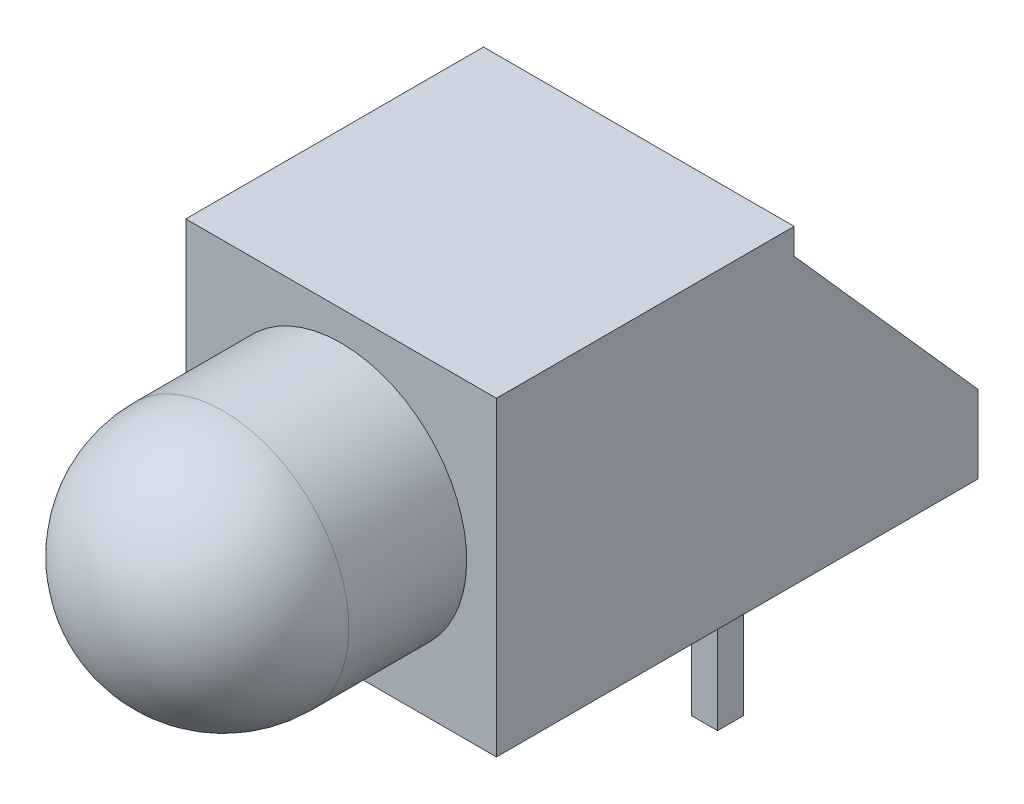
ISO-10303-21;
HEADER;
FILE_DESCRIPTION(('STEP AP214'),'2;1');
FILE_NAME('part.step','',(''),(''),'','','');
FILE_SCHEMA(('AUTOMOTIVE_DESIGN { 1 0 10303 214 1 1 1 1 }'));
ENDSEC;
DATA;
#1=APPLICATION_CONTEXT('core data for automotive mechanical design processes');
#2=APPLICATION_PROTOCOL_DEFINITION('international standard','automotive_design',2000,#1);
#3=PRODUCT_CONTEXT('',#1,'mechanical');
#4=PRODUCT('Part','Part','',(#3));
#5=PRODUCT_RELATED_PRODUCT_CATEGORY('part','',(#4));
#6=PRODUCT_DEFINITION_FORMATION('','',#4);
#7=PRODUCT_DEFINITION_CONTEXT('part definition',#1,'design');
#8=PRODUCT_DEFINITION('design','',#6,#7);
#9=PRODUCT_DEFINITION_SHAPE('','',#8);
#10=(LENGTH_UNIT() NAMED_UNIT(*) SI_UNIT(.MILLI.,.METRE.));
#11=(NAMED_UNIT(*) PLANE_ANGLE_UNIT() SI_UNIT($,.RADIAN.));
#12=(NAMED_UNIT(*) SI_UNIT($,.STERADIAN.) SOLID_ANGLE_UNIT());
#13=UNCERTAINTY_MEASURE_WITH_UNIT(LENGTH_MEASURE(1.E-05),#10,'distance_accuracy_value','');
#14=(GEOMETRIC_REPRESENTATION_CONTEXT(3) GLOBAL_UNCERTAINTY_ASSIGNED_CONTEXT((#13)) GLOBAL_UNIT_ASSIGNED_CONTEXT((#10,
#11,#12)) REPRESENTATION_CONTEXT('',''));
#15=CARTESIAN_POINT('',(0.,0.,0.));
#16=DIRECTION('',(0.,0.,1.));
#17=DIRECTION('',(1.,0.,0.));
#18=AXIS2_PLACEMENT_3D('',#15,#16,#17);
#19=CARTESIAN_POINT('',(3.,0.,6.));
#20=DIRECTION('',(0.,1.,0.));
#21=DIRECTION('',(0.,0.,1.));
#22=AXIS2_PLACEMENT_3D('',#19,#20,#21);
#23=PLANE('',#22);
#24=DIRECTION('',(0.,0.,-1.));
#25=VECTOR('',#24,1.);
#26=CARTESIAN_POINT('',(-1.52,0.,0.25));
#27=LINE('',#26,#25);
#28=CARTESIAN_POINT('',(-1.52,0.,0.25));
#29=VERTEX_POINT('',#28);
#30=CARTESIAN_POINT('',(-1.52,0.,-0.25));
#31=VERTEX_POINT('',#30);
#32=EDGE_CURVE('E140',#29,#31,#27,.T.);
#33=ORIENTED_EDGE('',*,*,#32,.F.);
#34=DIRECTION('',(-1.,0.,0.));
#35=VECTOR('',#34,1.);
#36=CARTESIAN_POINT('',(-1.52,0.,0.25));
#37=LINE('',#36,#35);
#38=CARTESIAN_POINT('',(-1.02,0.,0.25));
#39=VERTEX_POINT('',#38);
#40=EDGE_CURVE('E173',#39,#29,#37,.T.);
#41=ORIENTED_EDGE('',*,*,#40,.F.);
#42=DIRECTION('',(0.,0.,1.));
#43=VECTOR('',#42,1.);
#44=CARTESIAN_POINT('',(-1.02,0.,0.25));
#45=LINE('',#44,#43);
#46=CARTESIAN_POINT('',(-1.02,0.,-0.25));
#47=VERTEX_POINT('',#46);
#48=EDGE_CURVE('E185',#47,#39,#45,.T.);
#49=ORIENTED_EDGE('',*,*,#48,.F.);
#50=DIRECTION('',(1.,0.,0.));
#51=VECTOR('',#50,1.);
#52=CARTESIAN_POINT('',(-1.52,0.,-0.25));
#53=LINE('',#52,#51);
#54=EDGE_CURVE('E182',#31,#47,#53,.T.);
#55=ORIENTED_EDGE('',*,*,#54,.F.);
#56=EDGE_LOOP('',(#33,#41,#49,#55));
#57=FACE_BOUND('',#56,.T.);
#58=DIRECTION('',(0.,0.,-1.));
#59=VECTOR('',#58,1.);
#60=CARTESIAN_POINT('',(-3.,0.,6.));
#61=LINE('',#60,#59);
#62=CARTESIAN_POINT('',(-3.,0.,6.));
#63=VERTEX_POINT('',#62);
#64=CARTESIAN_POINT('',(-3.,0.,-3.3));
#65=VERTEX_POINT('',#64);
#66=EDGE_CURVE('E207',#63,#65,#61,.T.);
#67=ORIENTED_EDGE('',*,*,#66,.T.);
#68=DIRECTION('',(-1.,0.,0.));
#69=VECTOR('',#68,1.);
#70=CARTESIAN_POINT('',(3.,0.,-3.3));
#71=LINE('',#70,#69);
#72=CARTESIAN_POINT('',(3.,0.,-3.3));
#73=VERTEX_POINT('',#72);
#74=EDGE_CURVE('E11',#73,#65,#71,.T.);
#75=ORIENTED_EDGE('',*,*,#74,.F.);
#76=DIRECTION('',(0.,0.,-1.));
#77=VECTOR('',#76,1.);
#78=CARTESIAN_POINT('',(3.,0.,6.));
#79=LINE('',#78,#77);
#80=CARTESIAN_POINT('',(3.,0.,6.));
#81=VERTEX_POINT('',#80);
#82=EDGE_CURVE('E208',#81,#73,#79,.T.);
#83=ORIENTED_EDGE('',*,*,#82,.F.);
#84=DIRECTION('',(-1.,0.,0.));
#85=VECTOR('',#84,1.);
#86=CARTESIAN_POINT('',(3.,0.,6.));
#87=LINE('',#86,#85);
#88=EDGE_CURVE('E222',#81,#63,#87,.T.);
#89=ORIENTED_EDGE('',*,*,#88,.T.);
#90=EDGE_LOOP('',(#67,#75,#83,#89));
#91=FACE_BOUND('',#90,.T.);
#92=DIRECTION('',(0.,0.,1.));
#93=VECTOR('',#92,1.);
#94=CARTESIAN_POINT('',(1.52,0.,0.25));
#95=LINE('',#94,#93);
#96=CARTESIAN_POINT('',(1.52,0.,-0.25));
#97=VERTEX_POINT('',#96);
#98=CARTESIAN_POINT('',(1.52,0.,0.25));
#99=VERTEX_POINT('',#98);
#100=EDGE_CURVE('E134',#97,#99,#95,.T.);
#101=ORIENTED_EDGE('',*,*,#100,.F.);
#102=DIRECTION('',(1.,0.,0.));
#103=VECTOR('',#102,1.);
#104=CARTESIAN_POINT('',(1.52,0.,-0.25));
#105=LINE('',#104,#103);
#106=CARTESIAN_POINT('',(1.02,0.,-0.25));
#107=VERTEX_POINT('',#106);
#108=EDGE_CURVE('E136',#107,#97,#105,.T.);
#109=ORIENTED_EDGE('',*,*,#108,.F.);
#110=DIRECTION('',(0.,0.,-1.));
#111=VECTOR('',#110,1.);
#112=CARTESIAN_POINT('',(1.02,0.,0.25));
#113=LINE('',#112,#111);
#114=CARTESIAN_POINT('',(1.02,0.,0.25));
#115=VERTEX_POINT('',#114);
#116=EDGE_CURVE('E57',#115,#107,#113,.T.);
#117=ORIENTED_EDGE('',*,*,#116,.F.);
#118=DIRECTION('',(-1.,0.,0.));
#119=VECTOR('',#118,1.);
#120=CARTESIAN_POINT('',(1.52,0.,0.25));
#121=LINE('',#120,#119);
#122=EDGE_CURVE('E52',#99,#115,#121,.T.);
#123=ORIENTED_EDGE('',*,*,#122,.F.);
#124=EDGE_LOOP('',(#101,#109,#117,#123));
#125=FACE_BOUND('',#124,.T.);
#126=ADVANCED_FACE('F38',(#57,#91,#125),#23,.F.);
#127=CARTESIAN_POINT('',(3.,1.5,-3.3));
#128=DIRECTION('',(0.,0.,1.));
#129=DIRECTION('',(1.,0.,0.));
#130=AXIS2_PLACEMENT_3D('',#127,#128,#129);
#131=PLANE('',#130);
#132=DIRECTION('',(0.,1.,0.));
#133=VECTOR('',#132,1.);
#134=CARTESIAN_POINT('',(-3.,1.5,-3.3));
#135=LINE('',#134,#133);
#136=CARTESIAN_POINT('',(-3.,1.5,-3.3));
#137=VERTEX_POINT('',#136);
#138=EDGE_CURVE('E225',#65,#137,#135,.T.);
#139=ORIENTED_EDGE('',*,*,#138,.T.);
#140=DIRECTION('',(-1.,0.,0.));
#141=VECTOR('',#140,1.);
#142=CARTESIAN_POINT('',(3.,1.5,-3.3));
#143=LINE('',#142,#141);
#144=CARTESIAN_POINT('',(3.,1.5,-3.3));
#145=VERTEX_POINT('',#144);
#146=EDGE_CURVE('E45',#145,#137,#143,.T.);
#147=ORIENTED_EDGE('',*,*,#146,.F.);
#148=DIRECTION('',(0.,1.,0.));
#149=VECTOR('',#148,1.);
#150=CARTESIAN_POINT('',(3.,1.5,-3.3));
#151=LINE('',#150,#149);
#152=EDGE_CURVE('E211',#73,#145,#151,.T.);
#153=ORIENTED_EDGE('',*,*,#152,.F.);
#154=ORIENTED_EDGE('',*,*,#74,.T.);
#155=EDGE_LOOP('',(#139,#147,#153,#154));
#156=FACE_BOUND('',#155,.T.);
#157=ADVANCED_FACE('F272',(#156),#131,.F.);
#158=CARTESIAN_POINT('',(3.,5.5,0.25));
#159=DIRECTION('',(0.,-0.663783352029829,0.747924903695581));
#160=DIRECTION('',(0.,-0.747924903695581,-0.663783352029829));
#161=AXIS2_PLACEMENT_3D('',#158,#159,#160);
#162=PLANE('',#161);
#163=DIRECTION('',(0.,0.747924903695581,0.663783352029829));
#164=VECTOR('',#163,1.);
#165=CARTESIAN_POINT('',(-3.,5.5,0.25));
#166=LINE('',#165,#164);
#167=CARTESIAN_POINT('',(-3.,5.5,0.25));
#168=VERTEX_POINT('',#167);
#169=EDGE_CURVE('E227',#137,#168,#166,.T.);
#170=ORIENTED_EDGE('',*,*,#169,.T.);
#171=DIRECTION('',(-1.,0.,0.));
#172=VECTOR('',#171,1.);
#173=CARTESIAN_POINT('',(3.,5.5,0.25));
#174=LINE('',#173,#172);
#175=CARTESIAN_POINT('',(3.,5.5,0.25));
#176=VERTEX_POINT('',#175);
#177=EDGE_CURVE('E242',#176,#168,#174,.T.);
#178=ORIENTED_EDGE('',*,*,#177,.F.);
#179=DIRECTION('',(0.,0.747924903695581,0.663783352029829));
#180=VECTOR('',#179,1.);
#181=CARTESIAN_POINT('',(3.,5.5,0.25));
#182=LINE('',#181,#180);
#183=EDGE_CURVE('E214',#145,#176,#182,.T.);
#184=ORIENTED_EDGE('',*,*,#183,.F.);
#185=ORIENTED_EDGE('',*,*,#146,.T.);
#186=EDGE_LOOP('',(#170,#178,#184,#185));
#187=FACE_BOUND('',#186,.T.);
#188=ADVANCED_FACE('F249',(#187),#162,.F.);
#189=CARTESIAN_POINT('',(3.,6.,0.249999999999999));
#190=DIRECTION('',(0.,0.,1.));
#191=DIRECTION('',(0.,-1.,0.));
#192=AXIS2_PLACEMENT_3D('',#189,#190,#191);
#193=PLANE('',#192);
#194=DIRECTION('',(0.,1.,0.));
#195=VECTOR('',#194,1.);
#196=CARTESIAN_POINT('',(-3.,6.,0.249999999999999));
#197=LINE('',#196,#195);
#198=CARTESIAN_POINT('',(-3.,6.,0.249999999999999));
#199=VERTEX_POINT('',#198);
#200=EDGE_CURVE('E229',#168,#199,#197,.T.);
#201=ORIENTED_EDGE('',*,*,#200,.T.);
#202=DIRECTION('',(-1.,0.,0.));
#203=VECTOR('',#202,1.);
#204=CARTESIAN_POINT('',(3.,6.,0.249999999999999));
#205=LINE('',#204,#203);
#206=CARTESIAN_POINT('',(3.,6.,0.249999999999999));
#207=VERTEX_POINT('',#206);
#208=EDGE_CURVE('E239',#207,#199,#205,.T.);
#209=ORIENTED_EDGE('',*,*,#208,.F.);
#210=DIRECTION('',(0.,1.,0.));
#211=VECTOR('',#210,1.);
#212=CARTESIAN_POINT('',(3.,6.,0.249999999999999));
#213=LINE('',#212,#211);
#214=EDGE_CURVE('E216',#176,#207,#213,.T.);
#215=ORIENTED_EDGE('',*,*,#214,.F.);
#216=ORIENTED_EDGE('',*,*,#177,.T.);
#217=EDGE_LOOP('',(#201,#209,#215,#216));
#218=FACE_BOUND('',#217,.T.);
#219=ADVANCED_FACE('F260',(#218),#193,.F.);
#220=CARTESIAN_POINT('',(3.,6.,0.249999999999999));
#221=DIRECTION('',(0.,-1.,0.));
#222=DIRECTION('',(0.,0.,-1.));
#223=AXIS2_PLACEMENT_3D('',#220,#221,#222);
#224=PLANE('',#223);
#225=DIRECTION('',(0.,0.,1.));
#226=VECTOR('',#225,1.);
#227=CARTESIAN_POINT('',(-3.,6.,0.249999999999999));
#228=LINE('',#227,#226);
#229=CARTESIAN_POINT('',(-3.,6.,6.));
#230=VERTEX_POINT('',#229);
#231=EDGE_CURVE('E231',#199,#230,#228,.T.);
#232=ORIENTED_EDGE('',*,*,#231,.T.);
#233=DIRECTION('',(-1.,0.,0.));
#234=VECTOR('',#233,1.);
#235=CARTESIAN_POINT('',(3.,6.,6.));
#236=LINE('',#235,#234);
#237=CARTESIAN_POINT('',(3.,6.,6.));
#238=VERTEX_POINT('',#237);
#239=EDGE_CURVE('E236',#238,#230,#236,.T.);
#240=ORIENTED_EDGE('',*,*,#239,.F.);
#241=DIRECTION('',(0.,0.,1.));
#242=VECTOR('',#241,1.);
#243=CARTESIAN_POINT('',(3.,6.,0.249999999999999));
#244=LINE('',#243,#242);
#245=EDGE_CURVE('E218',#207,#238,#244,.T.);
#246=ORIENTED_EDGE('',*,*,#245,.F.);
#247=ORIENTED_EDGE('',*,*,#208,.T.);
#248=EDGE_LOOP('',(#232,#240,#246,#247));
#249=FACE_BOUND('',#248,.T.);
#250=ADVANCED_FACE('F264',(#249),#224,.F.);
#251=CARTESIAN_POINT('',(3.,6.,6.));
#252=DIRECTION('',(0.,0.,-1.));
#253=DIRECTION('',(0.,1.,0.));
#254=AXIS2_PLACEMENT_3D('',#251,#252,#253);
#255=PLANE('',#254);
#256=CARTESIAN_POINT('',(0.,3.,6.));
#257=DIRECTION('',(0.,0.,-1.));
#258=DIRECTION('',(0.,1.,0.));
#259=AXIS2_PLACEMENT_3D('',#256,#257,#258);
#260=CIRCLE('',#259,2.425);
#261=CARTESIAN_POINT('',(0.,5.425,6.));
#262=VERTEX_POINT('',#261);
#263=EDGE_CURVE('E204',#262,#262,#260,.T.);
#264=ORIENTED_EDGE('',*,*,#263,.T.);
#265=EDGE_LOOP('',(#264));
#266=FACE_BOUND('',#265,.T.);
#267=DIRECTION('',(0.,-1.,0.));
#268=VECTOR('',#267,1.);
#269=CARTESIAN_POINT('',(-3.,6.,6.));
#270=LINE('',#269,#268);
#271=EDGE_CURVE('E212',#230,#63,#270,.T.);
#272=ORIENTED_EDGE('',*,*,#271,.T.);
#273=ORIENTED_EDGE('',*,*,#88,.F.);
#274=DIRECTION('',(0.,-1.,0.));
#275=VECTOR('',#274,1.);
#276=CARTESIAN_POINT('',(3.,6.,6.));
#277=LINE('',#276,#275);
#278=EDGE_CURVE('E220',#238,#81,#277,.T.);
#279=ORIENTED_EDGE('',*,*,#278,.F.);
#280=ORIENTED_EDGE('',*,*,#239,.T.);
#281=EDGE_LOOP('',(#272,#273,#279,#280));
#282=FACE_BOUND('',#281,.T.);
#283=ADVANCED_FACE('F275',(#266,#282),#255,.F.);
#284=CARTESIAN_POINT('',(3.,0.,0.));
#285=DIRECTION('',(-1.,0.,0.));
#286=DIRECTION('',(0.,0.,1.));
#287=AXIS2_PLACEMENT_3D('',#284,#285,#286);
#288=PLANE('',#287);
#289=ORIENTED_EDGE('',*,*,#82,.T.);
#290=ORIENTED_EDGE('',*,*,#152,.T.);
#291=ORIENTED_EDGE('',*,*,#183,.T.);
#292=ORIENTED_EDGE('',*,*,#214,.T.);
#293=ORIENTED_EDGE('',*,*,#245,.T.);
#294=ORIENTED_EDGE('',*,*,#278,.T.);
#295=EDGE_LOOP('',(#289,#290,#291,#292,#293,#294));
#296=FACE_BOUND('',#295,.T.);
#297=ADVANCED_FACE('F268',(#296),#288,.F.);
#298=CARTESIAN_POINT('',(-3.,0.,0.));
#299=DIRECTION('',(-1.,0.,0.));
#300=DIRECTION('',(0.,0.,1.));
#301=AXIS2_PLACEMENT_3D('',#298,#299,#300);
#302=PLANE('',#301);
#303=ORIENTED_EDGE('',*,*,#66,.F.);
#304=ORIENTED_EDGE('',*,*,#271,.F.);
#305=ORIENTED_EDGE('',*,*,#231,.F.);
#306=ORIENTED_EDGE('',*,*,#200,.F.);
#307=ORIENTED_EDGE('',*,*,#169,.F.);
#308=ORIENTED_EDGE('',*,*,#138,.F.);
#309=EDGE_LOOP('',(#303,#304,#305,#306,#307,#308));
#310=FACE_BOUND('',#309,.T.);
#311=ADVANCED_FACE('F255',(#310),#302,.T.);
#312=CARTESIAN_POINT('',(0.,3.,6.));
#313=DIRECTION('',(0.,0.,-1.));
#314=DIRECTION('',(0.,1.,0.));
#315=AXIS2_PLACEMENT_3D('',#312,#313,#314);
#316=CYLINDRICAL_SURFACE('',#315,2.425);
#317=CARTESIAN_POINT('',(0.,3.,8.275));
#318=DIRECTION('',(0.,0.,-1.));
#319=DIRECTION('',(0.,1.,0.));
#320=AXIS2_PLACEMENT_3D('',#317,#318,#319);
#321=CIRCLE('',#320,2.425);
#322=CARTESIAN_POINT('',(0.,5.425,8.275));
#323=VERTEX_POINT('',#322);
#324=EDGE_CURVE('E201',#323,#323,#321,.T.);
#325=ORIENTED_EDGE('',*,*,#324,.T.);
#326=EDGE_LOOP('',(#325));
#327=FACE_BOUND('',#326,.T.);
#328=ORIENTED_EDGE('',*,*,#263,.F.);
#329=EDGE_LOOP('',(#328));
#330=FACE_BOUND('',#329,.T.);
#331=ADVANCED_FACE('F321',(#327,#330),#316,.T.);
#332=CARTESIAN_POINT('',(0.,3.,8.275));
#333=DIRECTION('',(0.,0.,-1.));
#334=DIRECTION('',(0.,1.,0.));
#335=AXIS2_PLACEMENT_3D('',#332,#333,#334);
#336=SPHERICAL_SURFACE('',#335,2.425);
#337=ORIENTED_EDGE('',*,*,#324,.F.);
#338=EDGE_LOOP('',(#337));
#339=FACE_BOUND('',#338,.T.);
#340=ADVANCED_FACE('F315',(#339),#336,.T.);
#341=CARTESIAN_POINT('',(-1.52,-3.175,0.25));
#342=DIRECTION('',(1.,0.,0.));
#343=DIRECTION('',(0.,0.,-1.));
#344=AXIS2_PLACEMENT_3D('',#341,#342,#343);
#345=PLANE('',#344);
#346=ORIENTED_EDGE('',*,*,#32,.T.);
#347=DIRECTION('',(0.,1.,0.));
#348=VECTOR('',#347,1.);
#349=CARTESIAN_POINT('',(-1.52,-3.175,-0.25));
#350=LINE('',#349,#348);
#351=CARTESIAN_POINT('',(-1.52,-3.175,-0.25));
#352=VERTEX_POINT('',#351);
#353=EDGE_CURVE('E198',#352,#31,#350,.T.);
#354=ORIENTED_EDGE('',*,*,#353,.F.);
#355=DIRECTION('',(0.,0.,-1.));
#356=VECTOR('',#355,1.);
#357=CARTESIAN_POINT('',(-1.52,-3.175,0.25));
#358=LINE('',#357,#356);
#359=CARTESIAN_POINT('',(-1.52,-3.175,0.25));
#360=VERTEX_POINT('',#359);
#361=EDGE_CURVE('E169',#360,#352,#358,.T.);
#362=ORIENTED_EDGE('',*,*,#361,.F.);
#363=DIRECTION('',(0.,1.,0.));
#364=VECTOR('',#363,1.);
#365=CARTESIAN_POINT('',(-1.52,-3.175,0.25));
#366=LINE('',#365,#364);
#367=EDGE_CURVE('E179',#360,#29,#366,.T.);
#368=ORIENTED_EDGE('',*,*,#367,.T.);
#369=EDGE_LOOP('',(#346,#354,#362,#368));
#370=FACE_BOUND('',#369,.T.);
#371=ADVANCED_FACE('F299',(#370),#345,.F.);
#372=CARTESIAN_POINT('',(-1.52,-3.175,-0.25));
#373=DIRECTION('',(0.,0.,1.));
#374=DIRECTION('',(1.,0.,0.));
#375=AXIS2_PLACEMENT_3D('',#372,#373,#374);
#376=PLANE('',#375);
#377=ORIENTED_EDGE('',*,*,#54,.T.);
#378=DIRECTION('',(0.,1.,0.));
#379=VECTOR('',#378,1.);
#380=CARTESIAN_POINT('',(-1.02,-3.175,-0.25));
#381=LINE('',#380,#379);
#382=CARTESIAN_POINT('',(-1.02,-3.175,-0.25));
#383=VERTEX_POINT('',#382);
#384=EDGE_CURVE('E195',#383,#47,#381,.T.);
#385=ORIENTED_EDGE('',*,*,#384,.F.);
#386=DIRECTION('',(1.,0.,0.));
#387=VECTOR('',#386,1.);
#388=CARTESIAN_POINT('',(-1.52,-3.175,-0.25));
#389=LINE('',#388,#387);
#390=EDGE_CURVE('E172',#352,#383,#389,.T.);
#391=ORIENTED_EDGE('',*,*,#390,.F.);
#392=ORIENTED_EDGE('',*,*,#353,.T.);
#393=EDGE_LOOP('',(#377,#385,#391,#392));
#394=FACE_BOUND('',#393,.T.);
#395=ADVANCED_FACE('F307',(#394),#376,.F.);
#396=CARTESIAN_POINT('',(-1.02,-3.175,0.25));
#397=DIRECTION('',(-1.,0.,0.));
#398=DIRECTION('',(0.,0.,1.));
#399=AXIS2_PLACEMENT_3D('',#396,#397,#398);
#400=PLANE('',#399);
#401=ORIENTED_EDGE('',*,*,#48,.T.);
#402=DIRECTION('',(0.,1.,0.));
#403=VECTOR('',#402,1.);
#404=CARTESIAN_POINT('',(-1.02,-3.175,0.25));
#405=LINE('',#404,#403);
#406=CARTESIAN_POINT('',(-1.02,-3.175,0.25));
#407=VERTEX_POINT('',#406);
#408=EDGE_CURVE('E192',#407,#39,#405,.T.);
#409=ORIENTED_EDGE('',*,*,#408,.F.);
#410=DIRECTION('',(0.,0.,1.));
#411=VECTOR('',#410,1.);
#412=CARTESIAN_POINT('',(-1.02,-3.175,0.25));
#413=LINE('',#412,#411);
#414=EDGE_CURVE('E175',#383,#407,#413,.T.);
#415=ORIENTED_EDGE('',*,*,#414,.F.);
#416=ORIENTED_EDGE('',*,*,#384,.T.);
#417=EDGE_LOOP('',(#401,#409,#415,#416));
#418=FACE_BOUND('',#417,.T.);
#419=ADVANCED_FACE('F305',(#418),#400,.F.);
#420=CARTESIAN_POINT('',(-1.52,-3.175,0.25));
#421=DIRECTION('',(0.,0.,-1.));
#422=DIRECTION('',(-1.,0.,0.));
#423=AXIS2_PLACEMENT_3D('',#420,#421,#422);
#424=PLANE('',#423);
#425=ORIENTED_EDGE('',*,*,#40,.T.);
#426=ORIENTED_EDGE('',*,*,#367,.F.);
#427=DIRECTION('',(-1.,0.,0.));
#428=VECTOR('',#427,1.);
#429=CARTESIAN_POINT('',(-1.52,-3.175,0.25));
#430=LINE('',#429,#428);
#431=EDGE_CURVE('E177',#407,#360,#430,.T.);
#432=ORIENTED_EDGE('',*,*,#431,.F.);
#433=ORIENTED_EDGE('',*,*,#408,.T.);
#434=EDGE_LOOP('',(#425,#426,#432,#433));
#435=FACE_BOUND('',#434,.T.);
#436=ADVANCED_FACE('F295',(#435),#424,.F.);
#437=CARTESIAN_POINT('',(0.,-3.175,0.));
#438=DIRECTION('',(0.,-1.,0.));
#439=DIRECTION('',(0.,0.,-1.));
#440=AXIS2_PLACEMENT_3D('',#437,#438,#439);
#441=PLANE('',#440);
#442=ORIENTED_EDGE('',*,*,#361,.T.);
#443=ORIENTED_EDGE('',*,*,#390,.T.);
#444=ORIENTED_EDGE('',*,*,#414,.T.);
#445=ORIENTED_EDGE('',*,*,#431,.T.);
#446=EDGE_LOOP('',(#442,#443,#444,#445));
#447=FACE_BOUND('',#446,.T.);
#448=ADVANCED_FACE('F301',(#447),#441,.T.);
#449=CARTESIAN_POINT('',(1.52,-3.175,0.25));
#450=DIRECTION('',(-1.,0.,0.));
#451=DIRECTION('',(0.,0.,1.));
#452=AXIS2_PLACEMENT_3D('',#449,#450,#451);
#453=PLANE('',#452);
#454=ORIENTED_EDGE('',*,*,#100,.T.);
#455=DIRECTION('',(0.,1.,0.));
#456=VECTOR('',#455,1.);
#457=CARTESIAN_POINT('',(1.52,-3.175,0.25));
#458=LINE('',#457,#456);
#459=CARTESIAN_POINT('',(1.52,-3.175,0.25));
#460=VERTEX_POINT('',#459);
#461=EDGE_CURVE('E543',#460,#99,#458,.T.);
#462=ORIENTED_EDGE('',*,*,#461,.F.);
#463=DIRECTION('',(0.,0.,1.));
#464=VECTOR('',#463,1.);
#465=CARTESIAN_POINT('',(1.52,-3.175,0.25));
#466=LINE('',#465,#464);
#467=CARTESIAN_POINT('',(1.52,-3.175,-0.25));
#468=VERTEX_POINT('',#467);
#469=EDGE_CURVE('E151',#468,#460,#466,.T.);
#470=ORIENTED_EDGE('',*,*,#469,.F.);
#471=DIRECTION('',(0.,1.,0.));
#472=VECTOR('',#471,1.);
#473=CARTESIAN_POINT('',(1.52,-3.175,-0.25));
#474=LINE('',#473,#472);
#475=EDGE_CURVE('E147',#468,#97,#474,.T.);
#476=ORIENTED_EDGE('',*,*,#475,.T.);
#477=EDGE_LOOP('',(#454,#462,#470,#476));
#478=FACE_BOUND('',#477,.T.);
#479=ADVANCED_FACE('F153',(#478),#453,.F.);
#480=CARTESIAN_POINT('',(1.52,-3.175,0.25));
#481=DIRECTION('',(0.,0.,-1.));
#482=DIRECTION('',(-1.,0.,0.));
#483=AXIS2_PLACEMENT_3D('',#480,#481,#482);
#484=PLANE('',#483);
#485=ORIENTED_EDGE('',*,*,#122,.T.);
#486=DIRECTION('',(0.,1.,0.));
#487=VECTOR('',#486,1.);
#488=CARTESIAN_POINT('',(1.02,-3.175,0.25));
#489=LINE('',#488,#487);
#490=CARTESIAN_POINT('',(1.02,-3.175,0.25));
#491=VERTEX_POINT('',#490);
#492=EDGE_CURVE('E159',#491,#115,#489,.T.);
#493=ORIENTED_EDGE('',*,*,#492,.F.);
#494=DIRECTION('',(-1.,0.,0.));
#495=VECTOR('',#494,1.);
#496=CARTESIAN_POINT('',(1.52,-3.175,0.25));
#497=LINE('',#496,#495);
#498=EDGE_CURVE('E166',#460,#491,#497,.T.);
#499=ORIENTED_EDGE('',*,*,#498,.F.);
#500=ORIENTED_EDGE('',*,*,#461,.T.);
#501=EDGE_LOOP('',(#485,#493,#499,#500));
#502=FACE_BOUND('',#501,.T.);
#503=ADVANCED_FACE('F373',(#502),#484,.F.);
#504=CARTESIAN_POINT('',(1.02,-3.175,0.25));
#505=DIRECTION('',(1.,0.,0.));
#506=DIRECTION('',(0.,0.,-1.));
#507=AXIS2_PLACEMENT_3D('',#504,#505,#506);
#508=PLANE('',#507);
#509=ORIENTED_EDGE('',*,*,#116,.T.);
#510=DIRECTION('',(0.,1.,0.));
#511=VECTOR('',#510,1.);
#512=CARTESIAN_POINT('',(1.02,-3.175,-0.25));
#513=LINE('',#512,#511);
#514=CARTESIAN_POINT('',(1.02,-3.175,-0.25));
#515=VERTEX_POINT('',#514);
#516=EDGE_CURVE('E150',#515,#107,#513,.T.);
#517=ORIENTED_EDGE('',*,*,#516,.F.);
#518=DIRECTION('',(0.,0.,-1.));
#519=VECTOR('',#518,1.);
#520=CARTESIAN_POINT('',(1.02,-3.175,0.25));
#521=LINE('',#520,#519);
#522=EDGE_CURVE('E157',#491,#515,#521,.T.);
#523=ORIENTED_EDGE('',*,*,#522,.F.);
#524=ORIENTED_EDGE('',*,*,#492,.T.);
#525=EDGE_LOOP('',(#509,#517,#523,#524));
#526=FACE_BOUND('',#525,.T.);
#527=ADVANCED_FACE('F380',(#526),#508,.F.);
#528=CARTESIAN_POINT('',(1.52,-3.175,-0.25));
#529=DIRECTION('',(0.,0.,1.));
#530=DIRECTION('',(1.,0.,0.));
#531=AXIS2_PLACEMENT_3D('',#528,#529,#530);
#532=PLANE('',#531);
#533=ORIENTED_EDGE('',*,*,#108,.T.);
#534=ORIENTED_EDGE('',*,*,#475,.F.);
#535=DIRECTION('',(1.,0.,0.));
#536=VECTOR('',#535,1.);
#537=CARTESIAN_POINT('',(1.52,-3.175,-0.25));
#538=LINE('',#537,#536);
#539=EDGE_CURVE('E155',#515,#468,#538,.T.);
#540=ORIENTED_EDGE('',*,*,#539,.F.);
#541=ORIENTED_EDGE('',*,*,#516,.T.);
#542=EDGE_LOOP('',(#533,#534,#540,#541));
#543=FACE_BOUND('',#542,.T.);
#544=ADVANCED_FACE('F145',(#543),#532,.F.);
#545=CARTESIAN_POINT('',(0.,-3.175,0.));
#546=DIRECTION('',(0.,1.,0.));
#547=DIRECTION('',(0.,0.,1.));
#548=AXIS2_PLACEMENT_3D('',#545,#546,#547);
#549=PLANE('',#548);
#550=ORIENTED_EDGE('',*,*,#469,.T.);
#551=ORIENTED_EDGE('',*,*,#498,.T.);
#552=ORIENTED_EDGE('',*,*,#522,.T.);
#553=ORIENTED_EDGE('',*,*,#539,.T.);
#554=EDGE_LOOP('',(#550,#551,#552,#553));
#555=FACE_BOUND('',#554,.T.);
#556=ADVANCED_FACE('F394',(#555),#549,.F.);
#557=CLOSED_SHELL('',(#126,#157,#188,#219,#250,#283,#297,#311,#331,#340,#371,#395,#419,#436,
#448,#479,#503,#527,#544,#556));
#558=MANIFOLD_SOLID_BREP('B2',#557);
#559=ADVANCED_BREP_SHAPE_REPRESENTATION('',(#18,#558),#14);
#560=SHAPE_DEFINITION_REPRESENTATION(#9,#559);
ENDSEC;
END-ISO-10303-21;
